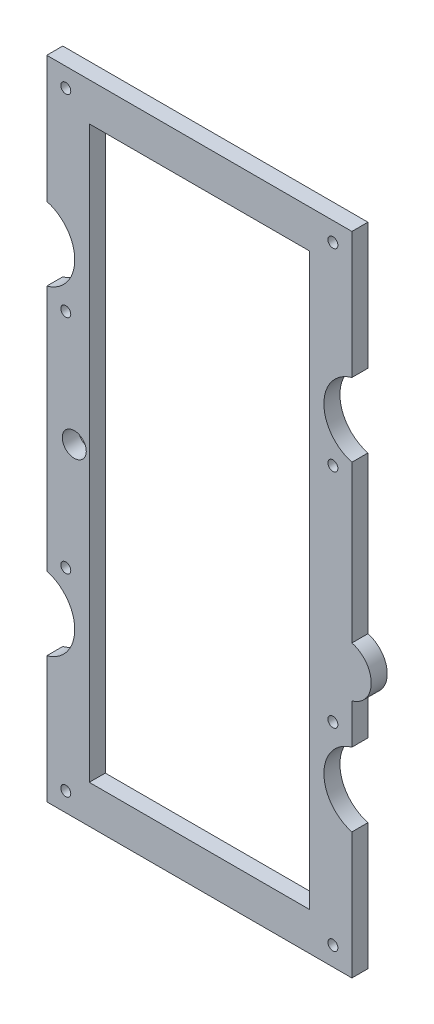
ISO-10303-21;
HEADER;
FILE_DESCRIPTION(('STEP AP214'),'2;1');
FILE_NAME('part.step','',(''),(''),'','','');
FILE_SCHEMA(('AUTOMOTIVE_DESIGN { 1 0 10303 214 1 1 1 1 }'));
ENDSEC;
DATA;
#1=APPLICATION_CONTEXT('core data for automotive mechanical design processes');
#2=APPLICATION_PROTOCOL_DEFINITION('international standard','automotive_design',2000,#1);
#3=PRODUCT_CONTEXT('',#1,'mechanical');
#4=PRODUCT('Part','Part','',(#3));
#5=PRODUCT_RELATED_PRODUCT_CATEGORY('part','',(#4));
#6=PRODUCT_DEFINITION_FORMATION('','',#4);
#7=PRODUCT_DEFINITION_CONTEXT('part definition',#1,'design');
#8=PRODUCT_DEFINITION('design','',#6,#7);
#9=PRODUCT_DEFINITION_SHAPE('','',#8);
#10=(LENGTH_UNIT() NAMED_UNIT(*) SI_UNIT(.MILLI.,.METRE.));
#11=(NAMED_UNIT(*) PLANE_ANGLE_UNIT() SI_UNIT($,.RADIAN.));
#12=(NAMED_UNIT(*) SI_UNIT($,.STERADIAN.) SOLID_ANGLE_UNIT());
#13=UNCERTAINTY_MEASURE_WITH_UNIT(LENGTH_MEASURE(1.E-05),#10,'distance_accuracy_value','');
#14=(GEOMETRIC_REPRESENTATION_CONTEXT(3) GLOBAL_UNCERTAINTY_ASSIGNED_CONTEXT((#13)) GLOBAL_UNIT_ASSIGNED_CONTEXT((#10,
#11,#12)) REPRESENTATION_CONTEXT('',''));
#15=CARTESIAN_POINT('',(0.,0.,0.));
#16=DIRECTION('',(0.,0.,1.));
#17=DIRECTION('',(1.,0.,0.));
#18=AXIS2_PLACEMENT_3D('',#15,#16,#17);
#19=CARTESIAN_POINT('',(-66.080112923463,-920.000000000007,8.));
#20=DIRECTION('',(0.,0.,1.));
#21=DIRECTION('',(1.,0.,0.));
#22=AXIS2_PLACEMENT_3D('',#19,#20,#21);
#23=PLANE('',#22);
#24=CARTESIAN_POINT('',(-47.330112923463,-1000.00000000001,8.));
#25=DIRECTION('',(0.,0.,1.));
#26=DIRECTION('',(1.,0.,0.));
#27=AXIS2_PLACEMENT_3D('',#24,#25,#26);
#28=CIRCLE('',#27,6.);
#29=CARTESIAN_POINT('',(-41.330112923463,-1000.00000000001,8.));
#30=VERTEX_POINT('',#29);
#31=EDGE_CURVE('E191',#30,#30,#28,.T.);
#32=ORIENTED_EDGE('',*,*,#31,.F.);
#33=EDGE_LOOP('',(#32));
#34=FACE_BOUND('',#33,.T.);
#35=DIRECTION('',(0.,-1.,0.));
#36=VECTOR('',#35,1.);
#37=CARTESIAN_POINT('',(70.1698870765371,-857.500000000008,8.));
#38=LINE('',#37,#36);
#39=CARTESIAN_POINT('',(70.1698870765371,-857.500000000008,8.));
#40=VERTEX_POINT('',#39);
#41=CARTESIAN_POINT('',(70.169887076537,-1142.50000000001,8.));
#42=VERTEX_POINT('',#41);
#43=EDGE_CURVE('E170',#40,#42,#38,.T.);
#44=ORIENTED_EDGE('',*,*,#43,.T.);
#45=DIRECTION('',(-1.,0.,0.));
#46=VECTOR('',#45,1.);
#47=CARTESIAN_POINT('',(70.169887076537,-1142.50000000001,8.));
#48=LINE('',#47,#46);
#49=CARTESIAN_POINT('',(-39.830112923463,-1142.50000000001,8.));
#50=VERTEX_POINT('',#49);
#51=EDGE_CURVE('E179',#42,#50,#48,.T.);
#52=ORIENTED_EDGE('',*,*,#51,.T.);
#53=DIRECTION('',(0.,1.,0.));
#54=VECTOR('',#53,1.);
#55=CARTESIAN_POINT('',(-39.8301129234629,-857.500000000008,8.));
#56=LINE('',#55,#54);
#57=CARTESIAN_POINT('',(-39.8301129234629,-857.500000000008,8.));
#58=VERTEX_POINT('',#57);
#59=EDGE_CURVE('E58',#50,#58,#56,.T.);
#60=ORIENTED_EDGE('',*,*,#59,.T.);
#61=DIRECTION('',(1.,0.,0.));
#62=VECTOR('',#61,1.);
#63=CARTESIAN_POINT('',(70.1698870765371,-857.500000000008,8.));
#64=LINE('',#63,#62);
#65=EDGE_CURVE('E176',#58,#40,#64,.T.);
#66=ORIENTED_EDGE('',*,*,#65,.T.);
#67=EDGE_LOOP('',(#44,#52,#60,#66));
#68=FACE_BOUND('',#67,.T.);
#69=CARTESIAN_POINT('',(-51.580112923463,-1152.06262000001,8.));
#70=DIRECTION('',(0.,0.,1.));
#71=DIRECTION('',(1.,0.,0.));
#72=AXIS2_PLACEMENT_3D('',#69,#70,#71);
#73=CIRCLE('',#72,2.50000000000014);
#74=CARTESIAN_POINT('',(-49.0801129234629,-1152.06262000001,8.));
#75=VERTEX_POINT('',#74);
#76=EDGE_CURVE('E214',#75,#75,#73,.T.);
#77=ORIENTED_EDGE('',*,*,#76,.F.);
#78=EDGE_LOOP('',(#77));
#79=FACE_BOUND('',#78,.T.);
#80=CARTESIAN_POINT('',(81.9198870765371,-1055.46431170724,8.));
#81=DIRECTION('',(0.,0.,1.));
#82=DIRECTION('',(1.,0.,0.));
#83=AXIS2_PLACEMENT_3D('',#80,#81,#82);
#84=CIRCLE('',#83,2.49999999999987);
#85=CARTESIAN_POINT('',(84.4198870765369,-1055.46431170724,8.));
#86=VERTEX_POINT('',#85);
#87=EDGE_CURVE('E226',#86,#86,#84,.T.);
#88=ORIENTED_EDGE('',*,*,#87,.F.);
#89=EDGE_LOOP('',(#88));
#90=FACE_BOUND('',#89,.T.);
#91=CARTESIAN_POINT('',(81.9198870765371,-847.937380000007,8.));
#92=DIRECTION('',(0.,0.,1.));
#93=DIRECTION('',(1.,0.,0.));
#94=AXIS2_PLACEMENT_3D('',#91,#92,#93);
#95=CIRCLE('',#94,2.5);
#96=CARTESIAN_POINT('',(84.4198870765371,-847.937380000007,8.));
#97=VERTEX_POINT('',#96);
#98=EDGE_CURVE('E238',#97,#97,#95,.T.);
#99=ORIENTED_EDGE('',*,*,#98,.F.);
#100=EDGE_LOOP('',(#99));
#101=FACE_BOUND('',#100,.T.);
#102=CARTESIAN_POINT('',(81.9198870765371,-944.535688292778,8.));
#103=DIRECTION('',(0.,0.,1.));
#104=DIRECTION('',(1.,0.,0.));
#105=AXIS2_PLACEMENT_3D('',#102,#103,#104);
#106=CIRCLE('',#105,2.5);
#107=CARTESIAN_POINT('',(84.4198870765371,-944.535688292778,8.));
#108=VERTEX_POINT('',#107);
#109=EDGE_CURVE('E250',#108,#108,#106,.T.);
#110=ORIENTED_EDGE('',*,*,#109,.F.);
#111=EDGE_LOOP('',(#110));
#112=FACE_BOUND('',#111,.T.);
#113=CARTESIAN_POINT('',(-66.080112923463,-920.000000000007,8.));
#114=DIRECTION('',(0.,0.,-1.));
#115=DIRECTION('',(1.,0.,0.));
#116=AXIS2_PLACEMENT_3D('',#113,#114,#115);
#117=CIRCLE('',#116,18.9999999999999);
#118=CARTESIAN_POINT('',(-61.0801129234629,-901.669697220184,8.));
#119=VERTEX_POINT('',#118);
#120=CARTESIAN_POINT('',(-61.080112923463,-938.33030277983,8.));
#121=VERTEX_POINT('',#120);
#122=EDGE_CURVE('E256',#119,#121,#117,.T.);
#123=ORIENTED_EDGE('',*,*,#122,.T.);
#124=DIRECTION('',(0.,-1.,0.));
#125=VECTOR('',#124,1.);
#126=CARTESIAN_POINT('',(-61.080112923463,-938.33030277983,8.));
#127=LINE('',#126,#125);
#128=CARTESIAN_POINT('',(-61.080112923463,-1061.66969722018,8.));
#129=VERTEX_POINT('',#128);
#130=EDGE_CURVE('E259',#121,#129,#127,.T.);
#131=ORIENTED_EDGE('',*,*,#130,.T.);
#132=CARTESIAN_POINT('',(-66.080112923463,-1080.00000000001,8.));
#133=DIRECTION('',(0.,0.,-1.));
#134=DIRECTION('',(1.,0.,0.));
#135=AXIS2_PLACEMENT_3D('',#132,#133,#134);
#136=CIRCLE('',#135,19.);
#137=CARTESIAN_POINT('',(-61.080112923463,-1098.33030277983,8.));
#138=VERTEX_POINT('',#137);
#139=EDGE_CURVE('E262',#129,#138,#136,.T.);
#140=ORIENTED_EDGE('',*,*,#139,.T.);
#141=DIRECTION('',(0.,-1.,0.));
#142=VECTOR('',#141,1.);
#143=CARTESIAN_POINT('',(-61.080112923463,-1098.33030277983,8.));
#144=LINE('',#143,#142);
#145=CARTESIAN_POINT('',(-61.080112923463,-1161.56262000001,8.));
#146=VERTEX_POINT('',#145);
#147=EDGE_CURVE('E264',#138,#146,#144,.T.);
#148=ORIENTED_EDGE('',*,*,#147,.T.);
#149=DIRECTION('',(1.,0.,0.));
#150=VECTOR('',#149,1.);
#151=CARTESIAN_POINT('',(-61.080112923463,-1161.56262000001,8.));
#152=LINE('',#151,#150);
#153=CARTESIAN_POINT('',(91.4198870765371,-1161.56262000001,8.));
#154=VERTEX_POINT('',#153);
#155=EDGE_CURVE('E266',#146,#154,#152,.T.);
#156=ORIENTED_EDGE('',*,*,#155,.T.);
#157=DIRECTION('',(0.,1.,0.));
#158=VECTOR('',#157,1.);
#159=CARTESIAN_POINT('',(91.4198870765371,-1161.56262000001,8.));
#160=LINE('',#159,#158);
#161=CARTESIAN_POINT('',(91.4198870765371,-1098.33030277983,8.));
#162=VERTEX_POINT('',#161);
#163=EDGE_CURVE('E268',#154,#162,#160,.T.);
#164=ORIENTED_EDGE('',*,*,#163,.T.);
#165=CARTESIAN_POINT('',(96.4198870765371,-1080.00000000001,8.));
#166=DIRECTION('',(0.,0.,-1.));
#167=DIRECTION('',(1.,0.,0.));
#168=AXIS2_PLACEMENT_3D('',#165,#166,#167);
#169=CIRCLE('',#168,19.);
#170=CARTESIAN_POINT('',(91.4198870765371,-1061.66969722018,8.));
#171=VERTEX_POINT('',#170);
#172=EDGE_CURVE('E270',#162,#171,#169,.T.);
#173=ORIENTED_EDGE('',*,*,#172,.T.);
#174=DIRECTION('',(0.,1.,0.));
#175=VECTOR('',#174,1.);
#176=CARTESIAN_POINT('',(91.4198870765371,-1061.66969722018,8.));
#177=LINE('',#176,#175);
#178=CARTESIAN_POINT('',(91.4198870765371,-1041.59686833573,8.));
#179=VERTEX_POINT('',#178);
#180=EDGE_CURVE('E272',#171,#179,#177,.T.);
#181=ORIENTED_EDGE('',*,*,#180,.T.);
#182=CARTESIAN_POINT('',(88.1478081868197,-1029.07998350006,8.));
#183=DIRECTION('',(0.,0.,1.));
#184=DIRECTION('',(1.,0.,0.));
#185=AXIS2_PLACEMENT_3D('',#182,#183,#184);
#186=CIRCLE('',#185,12.9375);
#187=CARTESIAN_POINT('',(91.4198870765371,-1016.56309866439,8.));
#188=VERTEX_POINT('',#187);
#189=EDGE_CURVE('E274',#179,#188,#186,.T.);
#190=ORIENTED_EDGE('',*,*,#189,.T.);
#191=DIRECTION('',(0.,1.,0.));
#192=VECTOR('',#191,1.);
#193=CARTESIAN_POINT('',(91.4198870765371,-1016.56309866439,8.));
#194=LINE('',#193,#192);
#195=CARTESIAN_POINT('',(91.4198870765371,-938.33030277983,8.));
#196=VERTEX_POINT('',#195);
#197=EDGE_CURVE('E276',#188,#196,#194,.T.);
#198=ORIENTED_EDGE('',*,*,#197,.T.);
#199=CARTESIAN_POINT('',(96.4198870765371,-920.000000000007,8.));
#200=DIRECTION('',(0.,0.,-1.));
#201=DIRECTION('',(1.,0.,0.));
#202=AXIS2_PLACEMENT_3D('',#199,#200,#201);
#203=CIRCLE('',#202,18.9999999999999);
#204=CARTESIAN_POINT('',(91.4198870765371,-901.669697220184,8.));
#205=VERTEX_POINT('',#204);
#206=EDGE_CURVE('E278',#196,#205,#203,.T.);
#207=ORIENTED_EDGE('',*,*,#206,.T.);
#208=DIRECTION('',(0.,1.,0.));
#209=VECTOR('',#208,1.);
#210=CARTESIAN_POINT('',(91.4198870765371,-901.669697220184,8.));
#211=LINE('',#210,#209);
#212=CARTESIAN_POINT('',(91.4198870765371,-838.437380000007,8.));
#213=VERTEX_POINT('',#212);
#214=EDGE_CURVE('E280',#205,#213,#211,.T.);
#215=ORIENTED_EDGE('',*,*,#214,.T.);
#216=DIRECTION('',(-1.,0.,0.));
#217=VECTOR('',#216,1.);
#218=CARTESIAN_POINT('',(91.4198870765371,-838.437380000007,8.));
#219=LINE('',#218,#217);
#220=CARTESIAN_POINT('',(-61.080112923463,-838.437380000007,8.));
#221=VERTEX_POINT('',#220);
#222=EDGE_CURVE('E282',#213,#221,#219,.T.);
#223=ORIENTED_EDGE('',*,*,#222,.T.);
#224=DIRECTION('',(0.,-1.,0.));
#225=VECTOR('',#224,1.);
#226=CARTESIAN_POINT('',(-61.080112923463,-838.437380000007,8.));
#227=LINE('',#226,#225);
#228=EDGE_CURVE('E284',#221,#119,#227,.T.);
#229=ORIENTED_EDGE('',*,*,#228,.T.);
#230=EDGE_LOOP('',(#123,#131,#140,#148,#156,#164,#173,#181,#190,#198,#207,#215,#223,#229));
#231=FACE_BOUND('',#230,.T.);
#232=CARTESIAN_POINT('',(-51.580112923463,-944.535688292778,8.));
#233=DIRECTION('',(0.,0.,1.));
#234=DIRECTION('',(1.,0.,0.));
#235=AXIS2_PLACEMENT_3D('',#232,#233,#234);
#236=CIRCLE('',#235,2.50000000000001);
#237=CARTESIAN_POINT('',(-49.080112923463,-944.535688292778,8.));
#238=VERTEX_POINT('',#237);
#239=EDGE_CURVE('E244',#238,#238,#236,.T.);
#240=ORIENTED_EDGE('',*,*,#239,.F.);
#241=EDGE_LOOP('',(#240));
#242=FACE_BOUND('',#241,.T.);
#243=CARTESIAN_POINT('',(-51.580112923463,-1055.46431170724,8.));
#244=DIRECTION('',(0.,0.,1.));
#245=DIRECTION('',(1.,0.,0.));
#246=AXIS2_PLACEMENT_3D('',#243,#244,#245);
#247=CIRCLE('',#246,2.49999999999988);
#248=CARTESIAN_POINT('',(-49.0801129234631,-1055.46431170724,8.));
#249=VERTEX_POINT('',#248);
#250=EDGE_CURVE('E232',#249,#249,#247,.T.);
#251=ORIENTED_EDGE('',*,*,#250,.F.);
#252=EDGE_LOOP('',(#251));
#253=FACE_BOUND('',#252,.T.);
#254=CARTESIAN_POINT('',(81.9198870765371,-1152.06262000001,8.));
#255=DIRECTION('',(0.,0.,1.));
#256=DIRECTION('',(1.,0.,0.));
#257=AXIS2_PLACEMENT_3D('',#254,#255,#256);
#258=CIRCLE('',#257,2.49999999999987);
#259=CARTESIAN_POINT('',(84.4198870765369,-1152.06262000001,8.));
#260=VERTEX_POINT('',#259);
#261=EDGE_CURVE('E220',#260,#260,#258,.T.);
#262=ORIENTED_EDGE('',*,*,#261,.F.);
#263=EDGE_LOOP('',(#262));
#264=FACE_BOUND('',#263,.T.);
#265=CARTESIAN_POINT('',(-51.580112923463,-847.937380000007,8.));
#266=DIRECTION('',(0.,0.,1.));
#267=DIRECTION('',(1.,0.,0.));
#268=AXIS2_PLACEMENT_3D('',#265,#266,#267);
#269=CIRCLE('',#268,2.50000000000001);
#270=CARTESIAN_POINT('',(-49.080112923463,-847.937380000007,8.));
#271=VERTEX_POINT('',#270);
#272=EDGE_CURVE('E208',#271,#271,#269,.T.);
#273=ORIENTED_EDGE('',*,*,#272,.F.);
#274=EDGE_LOOP('',(#273));
#275=FACE_BOUND('',#274,.T.);
#276=ADVANCED_FACE('F43',(#34,#68,#79,#90,#101,#112,#231,#242,#253,#264,#275),#23,.T.);
#277=CARTESIAN_POINT('',(-66.080112923463,-920.000000000007,0.));
#278=DIRECTION('',(0.,0.,1.));
#279=DIRECTION('',(1.,0.,0.));
#280=AXIS2_PLACEMENT_3D('',#277,#278,#279);
#281=PLANE('',#280);
#282=CARTESIAN_POINT('',(-47.330112923463,-1000.00000000001,0.));
#283=DIRECTION('',(0.,0.,1.));
#284=DIRECTION('',(1.,0.,0.));
#285=AXIS2_PLACEMENT_3D('',#282,#283,#284);
#286=CIRCLE('',#285,6.);
#287=CARTESIAN_POINT('',(-41.330112923463,-1000.00000000001,0.));
#288=VERTEX_POINT('',#287);
#289=EDGE_CURVE('E198',#288,#288,#286,.T.);
#290=ORIENTED_EDGE('',*,*,#289,.T.);
#291=EDGE_LOOP('',(#290));
#292=FACE_BOUND('',#291,.T.);
#293=DIRECTION('',(-1.,0.,0.));
#294=VECTOR('',#293,1.);
#295=CARTESIAN_POINT('',(70.169887076537,-1142.50000000001,0.));
#296=LINE('',#295,#294);
#297=CARTESIAN_POINT('',(70.169887076537,-1142.50000000001,0.));
#298=VERTEX_POINT('',#297);
#299=CARTESIAN_POINT('',(-39.830112923463,-1142.50000000001,0.));
#300=VERTEX_POINT('',#299);
#301=EDGE_CURVE('E197',#298,#300,#296,.T.);
#302=ORIENTED_EDGE('',*,*,#301,.F.);
#303=DIRECTION('',(0.,-1.,0.));
#304=VECTOR('',#303,1.);
#305=CARTESIAN_POINT('',(70.1698870765371,-857.500000000008,0.));
#306=LINE('',#305,#304);
#307=CARTESIAN_POINT('',(70.1698870765371,-857.500000000008,0.));
#308=VERTEX_POINT('',#307);
#309=EDGE_CURVE('E66',#308,#298,#306,.T.);
#310=ORIENTED_EDGE('',*,*,#309,.F.);
#311=DIRECTION('',(1.,0.,0.));
#312=VECTOR('',#311,1.);
#313=CARTESIAN_POINT('',(70.1698870765371,-857.500000000008,0.));
#314=LINE('',#313,#312);
#315=CARTESIAN_POINT('',(-39.8301129234629,-857.500000000008,0.));
#316=VERTEX_POINT('',#315);
#317=EDGE_CURVE('E185',#316,#308,#314,.T.);
#318=ORIENTED_EDGE('',*,*,#317,.F.);
#319=DIRECTION('',(0.,1.,0.));
#320=VECTOR('',#319,1.);
#321=CARTESIAN_POINT('',(-39.8301129234629,-857.500000000008,0.));
#322=LINE('',#321,#320);
#323=EDGE_CURVE('E188',#300,#316,#322,.T.);
#324=ORIENTED_EDGE('',*,*,#323,.F.);
#325=EDGE_LOOP('',(#302,#310,#318,#324));
#326=FACE_BOUND('',#325,.T.);
#327=CARTESIAN_POINT('',(-66.080112923463,-920.000000000007,0.));
#328=DIRECTION('',(0.,0.,-1.));
#329=DIRECTION('',(1.,0.,0.));
#330=AXIS2_PLACEMENT_3D('',#327,#328,#329);
#331=CIRCLE('',#330,18.9999999999999);
#332=CARTESIAN_POINT('',(-61.0801129234629,-901.669697220184,0.));
#333=VERTEX_POINT('',#332);
#334=CARTESIAN_POINT('',(-61.080112923463,-938.33030277983,0.));
#335=VERTEX_POINT('',#334);
#336=EDGE_CURVE('E253',#333,#335,#331,.T.);
#337=ORIENTED_EDGE('',*,*,#336,.F.);
#338=DIRECTION('',(0.,-1.,0.));
#339=VECTOR('',#338,1.);
#340=CARTESIAN_POINT('',(-61.080112923463,-838.437380000007,0.));
#341=LINE('',#340,#339);
#342=CARTESIAN_POINT('',(-61.080112923463,-838.437380000007,0.));
#343=VERTEX_POINT('',#342);
#344=EDGE_CURVE('E260',#343,#333,#341,.T.);
#345=ORIENTED_EDGE('',*,*,#344,.F.);
#346=DIRECTION('',(-1.,0.,0.));
#347=VECTOR('',#346,1.);
#348=CARTESIAN_POINT('',(91.4198870765371,-838.437380000007,0.));
#349=LINE('',#348,#347);
#350=CARTESIAN_POINT('',(91.4198870765371,-838.437380000007,0.));
#351=VERTEX_POINT('',#350);
#352=EDGE_CURVE('E311',#351,#343,#349,.T.);
#353=ORIENTED_EDGE('',*,*,#352,.F.);
#354=DIRECTION('',(0.,1.,0.));
#355=VECTOR('',#354,1.);
#356=CARTESIAN_POINT('',(91.4198870765371,-901.669697220184,0.));
#357=LINE('',#356,#355);
#358=CARTESIAN_POINT('',(91.4198870765371,-901.669697220184,0.));
#359=VERTEX_POINT('',#358);
#360=EDGE_CURVE('E309',#359,#351,#357,.T.);
#361=ORIENTED_EDGE('',*,*,#360,.F.);
#362=CARTESIAN_POINT('',(96.4198870765371,-920.000000000007,0.));
#363=DIRECTION('',(0.,0.,-1.));
#364=DIRECTION('',(1.,0.,0.));
#365=AXIS2_PLACEMENT_3D('',#362,#363,#364);
#366=CIRCLE('',#365,18.9999999999999);
#367=CARTESIAN_POINT('',(91.4198870765371,-938.33030277983,0.));
#368=VERTEX_POINT('',#367);
#369=EDGE_CURVE('E307',#368,#359,#366,.T.);
#370=ORIENTED_EDGE('',*,*,#369,.F.);
#371=DIRECTION('',(0.,1.,0.));
#372=VECTOR('',#371,1.);
#373=CARTESIAN_POINT('',(91.4198870765371,-1016.56309866439,0.));
#374=LINE('',#373,#372);
#375=CARTESIAN_POINT('',(91.4198870765371,-1016.56309866439,0.));
#376=VERTEX_POINT('',#375);
#377=EDGE_CURVE('E305',#376,#368,#374,.T.);
#378=ORIENTED_EDGE('',*,*,#377,.F.);
#379=CARTESIAN_POINT('',(88.1478081868197,-1029.07998350006,0.));
#380=DIRECTION('',(0.,0.,1.));
#381=DIRECTION('',(1.,0.,0.));
#382=AXIS2_PLACEMENT_3D('',#379,#380,#381);
#383=CIRCLE('',#382,12.9375);
#384=CARTESIAN_POINT('',(91.4198870765371,-1041.59686833573,0.));
#385=VERTEX_POINT('',#384);
#386=EDGE_CURVE('E303',#385,#376,#383,.T.);
#387=ORIENTED_EDGE('',*,*,#386,.F.);
#388=DIRECTION('',(0.,1.,0.));
#389=VECTOR('',#388,1.);
#390=CARTESIAN_POINT('',(91.4198870765371,-1061.66969722018,0.));
#391=LINE('',#390,#389);
#392=CARTESIAN_POINT('',(91.4198870765371,-1061.66969722018,0.));
#393=VERTEX_POINT('',#392);
#394=EDGE_CURVE('E301',#393,#385,#391,.T.);
#395=ORIENTED_EDGE('',*,*,#394,.F.);
#396=CARTESIAN_POINT('',(96.4198870765371,-1080.00000000001,0.));
#397=DIRECTION('',(0.,0.,-1.));
#398=DIRECTION('',(1.,0.,0.));
#399=AXIS2_PLACEMENT_3D('',#396,#397,#398);
#400=CIRCLE('',#399,19.);
#401=CARTESIAN_POINT('',(91.4198870765371,-1098.33030277983,0.));
#402=VERTEX_POINT('',#401);
#403=EDGE_CURVE('E299',#402,#393,#400,.T.);
#404=ORIENTED_EDGE('',*,*,#403,.F.);
#405=DIRECTION('',(0.,1.,0.));
#406=VECTOR('',#405,1.);
#407=CARTESIAN_POINT('',(91.4198870765371,-1161.56262000001,0.));
#408=LINE('',#407,#406);
#409=CARTESIAN_POINT('',(91.4198870765371,-1161.56262000001,0.));
#410=VERTEX_POINT('',#409);
#411=EDGE_CURVE('E297',#410,#402,#408,.T.);
#412=ORIENTED_EDGE('',*,*,#411,.F.);
#413=DIRECTION('',(1.,0.,0.));
#414=VECTOR('',#413,1.);
#415=CARTESIAN_POINT('',(-61.080112923463,-1161.56262000001,0.));
#416=LINE('',#415,#414);
#417=CARTESIAN_POINT('',(-61.080112923463,-1161.56262000001,0.));
#418=VERTEX_POINT('',#417);
#419=EDGE_CURVE('E295',#418,#410,#416,.T.);
#420=ORIENTED_EDGE('',*,*,#419,.F.);
#421=DIRECTION('',(0.,-1.,0.));
#422=VECTOR('',#421,1.);
#423=CARTESIAN_POINT('',(-61.080112923463,-1098.33030277983,0.));
#424=LINE('',#423,#422);
#425=CARTESIAN_POINT('',(-61.080112923463,-1098.33030277983,0.));
#426=VERTEX_POINT('',#425);
#427=EDGE_CURVE('E293',#426,#418,#424,.T.);
#428=ORIENTED_EDGE('',*,*,#427,.F.);
#429=CARTESIAN_POINT('',(-66.080112923463,-1080.00000000001,0.));
#430=DIRECTION('',(0.,0.,-1.));
#431=DIRECTION('',(1.,0.,0.));
#432=AXIS2_PLACEMENT_3D('',#429,#430,#431);
#433=CIRCLE('',#432,19.);
#434=CARTESIAN_POINT('',(-61.080112923463,-1061.66969722018,0.));
#435=VERTEX_POINT('',#434);
#436=EDGE_CURVE('E291',#435,#426,#433,.T.);
#437=ORIENTED_EDGE('',*,*,#436,.F.);
#438=DIRECTION('',(0.,-1.,0.));
#439=VECTOR('',#438,1.);
#440=CARTESIAN_POINT('',(-61.080112923463,-938.33030277983,0.));
#441=LINE('',#440,#439);
#442=EDGE_CURVE('E289',#335,#435,#441,.T.);
#443=ORIENTED_EDGE('',*,*,#442,.F.);
#444=EDGE_LOOP('',(#337,#345,#353,#361,#370,#378,#387,#395,#404,#412,#420,#428,#437,#443));
#445=FACE_BOUND('',#444,.T.);
#446=CARTESIAN_POINT('',(81.9198870765371,-944.535688292778,0.));
#447=DIRECTION('',(0.,0.,1.));
#448=DIRECTION('',(1.,0.,0.));
#449=AXIS2_PLACEMENT_3D('',#446,#447,#448);
#450=CIRCLE('',#449,2.5);
#451=CARTESIAN_POINT('',(84.4198870765371,-944.535688292778,0.));
#452=VERTEX_POINT('',#451);
#453=EDGE_CURVE('E247',#452,#452,#450,.T.);
#454=ORIENTED_EDGE('',*,*,#453,.T.);
#455=EDGE_LOOP('',(#454));
#456=FACE_BOUND('',#455,.T.);
#457=CARTESIAN_POINT('',(-51.580112923463,-944.535688292778,0.));
#458=DIRECTION('',(0.,0.,1.));
#459=DIRECTION('',(1.,0.,0.));
#460=AXIS2_PLACEMENT_3D('',#457,#458,#459);
#461=CIRCLE('',#460,2.50000000000001);
#462=CARTESIAN_POINT('',(-49.080112923463,-944.535688292778,0.));
#463=VERTEX_POINT('',#462);
#464=EDGE_CURVE('E241',#463,#463,#461,.T.);
#465=ORIENTED_EDGE('',*,*,#464,.T.);
#466=EDGE_LOOP('',(#465));
#467=FACE_BOUND('',#466,.T.);
#468=CARTESIAN_POINT('',(81.9198870765371,-847.937380000007,0.));
#469=DIRECTION('',(0.,0.,1.));
#470=DIRECTION('',(1.,0.,0.));
#471=AXIS2_PLACEMENT_3D('',#468,#469,#470);
#472=CIRCLE('',#471,2.5);
#473=CARTESIAN_POINT('',(84.4198870765371,-847.937380000007,0.));
#474=VERTEX_POINT('',#473);
#475=EDGE_CURVE('E235',#474,#474,#472,.T.);
#476=ORIENTED_EDGE('',*,*,#475,.T.);
#477=EDGE_LOOP('',(#476));
#478=FACE_BOUND('',#477,.T.);
#479=CARTESIAN_POINT('',(-51.580112923463,-1055.46431170724,0.));
#480=DIRECTION('',(0.,0.,1.));
#481=DIRECTION('',(1.,0.,0.));
#482=AXIS2_PLACEMENT_3D('',#479,#480,#481);
#483=CIRCLE('',#482,2.49999999999988);
#484=CARTESIAN_POINT('',(-49.0801129234631,-1055.46431170724,0.));
#485=VERTEX_POINT('',#484);
#486=EDGE_CURVE('E229',#485,#485,#483,.T.);
#487=ORIENTED_EDGE('',*,*,#486,.T.);
#488=EDGE_LOOP('',(#487));
#489=FACE_BOUND('',#488,.T.);
#490=CARTESIAN_POINT('',(81.9198870765371,-1055.46431170724,0.));
#491=DIRECTION('',(0.,0.,1.));
#492=DIRECTION('',(1.,0.,0.));
#493=AXIS2_PLACEMENT_3D('',#490,#491,#492);
#494=CIRCLE('',#493,2.49999999999987);
#495=CARTESIAN_POINT('',(84.4198870765369,-1055.46431170724,0.));
#496=VERTEX_POINT('',#495);
#497=EDGE_CURVE('E223',#496,#496,#494,.T.);
#498=ORIENTED_EDGE('',*,*,#497,.T.);
#499=EDGE_LOOP('',(#498));
#500=FACE_BOUND('',#499,.T.);
#501=CARTESIAN_POINT('',(81.9198870765371,-1152.06262000001,0.));
#502=DIRECTION('',(0.,0.,1.));
#503=DIRECTION('',(1.,0.,0.));
#504=AXIS2_PLACEMENT_3D('',#501,#502,#503);
#505=CIRCLE('',#504,2.49999999999987);
#506=CARTESIAN_POINT('',(84.4198870765369,-1152.06262000001,0.));
#507=VERTEX_POINT('',#506);
#508=EDGE_CURVE('E217',#507,#507,#505,.T.);
#509=ORIENTED_EDGE('',*,*,#508,.T.);
#510=EDGE_LOOP('',(#509));
#511=FACE_BOUND('',#510,.T.);
#512=CARTESIAN_POINT('',(-51.580112923463,-1152.06262000001,0.));
#513=DIRECTION('',(0.,0.,1.));
#514=DIRECTION('',(1.,0.,0.));
#515=AXIS2_PLACEMENT_3D('',#512,#513,#514);
#516=CIRCLE('',#515,2.50000000000014);
#517=CARTESIAN_POINT('',(-49.0801129234629,-1152.06262000001,0.));
#518=VERTEX_POINT('',#517);
#519=EDGE_CURVE('E211',#518,#518,#516,.T.);
#520=ORIENTED_EDGE('',*,*,#519,.T.);
#521=EDGE_LOOP('',(#520));
#522=FACE_BOUND('',#521,.T.);
#523=CARTESIAN_POINT('',(-51.580112923463,-847.937380000007,0.));
#524=DIRECTION('',(0.,0.,1.));
#525=DIRECTION('',(1.,0.,0.));
#526=AXIS2_PLACEMENT_3D('',#523,#524,#525);
#527=CIRCLE('',#526,2.50000000000001);
#528=CARTESIAN_POINT('',(-49.080112923463,-847.937380000007,0.));
#529=VERTEX_POINT('',#528);
#530=EDGE_CURVE('E204',#529,#529,#527,.T.);
#531=ORIENTED_EDGE('',*,*,#530,.T.);
#532=EDGE_LOOP('',(#531));
#533=FACE_BOUND('',#532,.T.);
#534=ADVANCED_FACE('F359',(#292,#326,#445,#456,#467,#478,#489,#500,#511,#522,#533),#281,.F.);
#535=CARTESIAN_POINT('',(-66.080112923463,-920.000000000007,8.));
#536=DIRECTION('',(0.,0.,-1.));
#537=DIRECTION('',(-1.,0.,0.));
#538=AXIS2_PLACEMENT_3D('',#535,#536,#537);
#539=CYLINDRICAL_SURFACE('',#538,18.9999999999999);
#540=ORIENTED_EDGE('',*,*,#336,.T.);
#541=DIRECTION('',(0.,0.,-1.));
#542=VECTOR('',#541,1.);
#543=CARTESIAN_POINT('',(-61.080112923463,-938.33030277983,8.));
#544=LINE('',#543,#542);
#545=EDGE_CURVE('E11',#121,#335,#544,.T.);
#546=ORIENTED_EDGE('',*,*,#545,.F.);
#547=ORIENTED_EDGE('',*,*,#122,.F.);
#548=DIRECTION('',(0.,0.,-1.));
#549=VECTOR('',#548,1.);
#550=CARTESIAN_POINT('',(-61.0801129234629,-901.669697220184,8.));
#551=LINE('',#550,#549);
#552=EDGE_CURVE('E286',#119,#333,#551,.T.);
#553=ORIENTED_EDGE('',*,*,#552,.T.);
#554=EDGE_LOOP('',(#540,#546,#547,#553));
#555=FACE_BOUND('',#554,.T.);
#556=ADVANCED_FACE('F45',(#555),#539,.F.);
#557=CARTESIAN_POINT('',(-61.080112923463,-938.33030277983,8.));
#558=DIRECTION('',(1.,0.,0.));
#559=DIRECTION('',(0.,1.,0.));
#560=AXIS2_PLACEMENT_3D('',#557,#558,#559);
#561=PLANE('',#560);
#562=ORIENTED_EDGE('',*,*,#442,.T.);
#563=DIRECTION('',(0.,0.,-1.));
#564=VECTOR('',#563,1.);
#565=CARTESIAN_POINT('',(-61.080112923463,-1061.66969722018,8.));
#566=LINE('',#565,#564);
#567=EDGE_CURVE('E51',#129,#435,#566,.T.);
#568=ORIENTED_EDGE('',*,*,#567,.F.);
#569=ORIENTED_EDGE('',*,*,#130,.F.);
#570=ORIENTED_EDGE('',*,*,#545,.T.);
#571=EDGE_LOOP('',(#562,#568,#569,#570));
#572=FACE_BOUND('',#571,.T.);
#573=ADVANCED_FACE('F377',(#572),#561,.F.);
#574=CARTESIAN_POINT('',(-66.080112923463,-1080.00000000001,8.));
#575=DIRECTION('',(0.,0.,-1.));
#576=DIRECTION('',(-1.,0.,0.));
#577=AXIS2_PLACEMENT_3D('',#574,#575,#576);
#578=CYLINDRICAL_SURFACE('',#577,19.);
#579=ORIENTED_EDGE('',*,*,#436,.T.);
#580=DIRECTION('',(0.,0.,-1.));
#581=VECTOR('',#580,1.);
#582=CARTESIAN_POINT('',(-61.080112923463,-1098.33030277983,8.));
#583=LINE('',#582,#581);
#584=EDGE_CURVE('E346',#138,#426,#583,.T.);
#585=ORIENTED_EDGE('',*,*,#584,.F.);
#586=ORIENTED_EDGE('',*,*,#139,.F.);
#587=ORIENTED_EDGE('',*,*,#567,.T.);
#588=EDGE_LOOP('',(#579,#585,#586,#587));
#589=FACE_BOUND('',#588,.T.);
#590=ADVANCED_FACE('F353',(#589),#578,.F.);
#591=CARTESIAN_POINT('',(-61.080112923463,-1098.33030277983,8.));
#592=DIRECTION('',(1.,0.,0.));
#593=DIRECTION('',(0.,1.,0.));
#594=AXIS2_PLACEMENT_3D('',#591,#592,#593);
#595=PLANE('',#594);
#596=ORIENTED_EDGE('',*,*,#427,.T.);
#597=DIRECTION('',(0.,0.,-1.));
#598=VECTOR('',#597,1.);
#599=CARTESIAN_POINT('',(-61.080112923463,-1161.56262000001,8.));
#600=LINE('',#599,#598);
#601=EDGE_CURVE('E343',#146,#418,#600,.T.);
#602=ORIENTED_EDGE('',*,*,#601,.F.);
#603=ORIENTED_EDGE('',*,*,#147,.F.);
#604=ORIENTED_EDGE('',*,*,#584,.T.);
#605=EDGE_LOOP('',(#596,#602,#603,#604));
#606=FACE_BOUND('',#605,.T.);
#607=ADVANCED_FACE('F365',(#606),#595,.F.);
#608=CARTESIAN_POINT('',(-61.080112923463,-1161.56262000001,8.));
#609=DIRECTION('',(0.,1.,0.));
#610=DIRECTION('',(0.,0.,1.));
#611=AXIS2_PLACEMENT_3D('',#608,#609,#610);
#612=PLANE('',#611);
#613=ORIENTED_EDGE('',*,*,#419,.T.);
#614=DIRECTION('',(0.,0.,-1.));
#615=VECTOR('',#614,1.);
#616=CARTESIAN_POINT('',(91.4198870765371,-1161.56262000001,8.));
#617=LINE('',#616,#615);
#618=EDGE_CURVE('E340',#154,#410,#617,.T.);
#619=ORIENTED_EDGE('',*,*,#618,.F.);
#620=ORIENTED_EDGE('',*,*,#155,.F.);
#621=ORIENTED_EDGE('',*,*,#601,.T.);
#622=EDGE_LOOP('',(#613,#619,#620,#621));
#623=FACE_BOUND('',#622,.T.);
#624=ADVANCED_FACE('F369',(#623),#612,.F.);
#625=CARTESIAN_POINT('',(91.4198870765371,-1161.56262000001,8.));
#626=DIRECTION('',(-1.,0.,0.));
#627=DIRECTION('',(0.,-1.,0.));
#628=AXIS2_PLACEMENT_3D('',#625,#626,#627);
#629=PLANE('',#628);
#630=ORIENTED_EDGE('',*,*,#411,.T.);
#631=DIRECTION('',(0.,0.,-1.));
#632=VECTOR('',#631,1.);
#633=CARTESIAN_POINT('',(91.4198870765371,-1098.33030277983,8.));
#634=LINE('',#633,#632);
#635=EDGE_CURVE('E337',#162,#402,#634,.T.);
#636=ORIENTED_EDGE('',*,*,#635,.F.);
#637=ORIENTED_EDGE('',*,*,#163,.F.);
#638=ORIENTED_EDGE('',*,*,#618,.T.);
#639=EDGE_LOOP('',(#630,#636,#637,#638));
#640=FACE_BOUND('',#639,.T.);
#641=ADVANCED_FACE('F420',(#640),#629,.F.);
#642=CARTESIAN_POINT('',(96.4198870765371,-1080.00000000001,8.));
#643=DIRECTION('',(0.,0.,-1.));
#644=DIRECTION('',(-1.,0.,0.));
#645=AXIS2_PLACEMENT_3D('',#642,#643,#644);
#646=CYLINDRICAL_SURFACE('',#645,19.);
#647=ORIENTED_EDGE('',*,*,#403,.T.);
#648=DIRECTION('',(0.,0.,-1.));
#649=VECTOR('',#648,1.);
#650=CARTESIAN_POINT('',(91.4198870765371,-1061.66969722018,8.));
#651=LINE('',#650,#649);
#652=EDGE_CURVE('E334',#171,#393,#651,.T.);
#653=ORIENTED_EDGE('',*,*,#652,.F.);
#654=ORIENTED_EDGE('',*,*,#172,.F.);
#655=ORIENTED_EDGE('',*,*,#635,.T.);
#656=EDGE_LOOP('',(#647,#653,#654,#655));
#657=FACE_BOUND('',#656,.T.);
#658=ADVANCED_FACE('F418',(#657),#646,.F.);
#659=CARTESIAN_POINT('',(91.4198870765371,-1061.66969722018,8.));
#660=DIRECTION('',(-1.,0.,0.));
#661=DIRECTION('',(0.,0.,1.));
#662=AXIS2_PLACEMENT_3D('',#659,#660,#661);
#663=PLANE('',#662);
#664=ORIENTED_EDGE('',*,*,#394,.T.);
#665=DIRECTION('',(0.,0.,-1.));
#666=VECTOR('',#665,1.);
#667=CARTESIAN_POINT('',(91.4198870765371,-1041.59686833573,8.));
#668=LINE('',#667,#666);
#669=EDGE_CURVE('E331',#179,#385,#668,.T.);
#670=ORIENTED_EDGE('',*,*,#669,.F.);
#671=ORIENTED_EDGE('',*,*,#180,.F.);
#672=ORIENTED_EDGE('',*,*,#652,.T.);
#673=EDGE_LOOP('',(#664,#670,#671,#672));
#674=FACE_BOUND('',#673,.T.);
#675=ADVANCED_FACE('F413',(#674),#663,.F.);
#676=CARTESIAN_POINT('',(88.1478081868197,-1029.07998350006,8.));
#677=DIRECTION('',(0.,0.,-1.));
#678=DIRECTION('',(-1.,0.,0.));
#679=AXIS2_PLACEMENT_3D('',#676,#677,#678);
#680=CYLINDRICAL_SURFACE('',#679,12.9375);
#681=ORIENTED_EDGE('',*,*,#386,.T.);
#682=DIRECTION('',(0.,0.,-1.));
#683=VECTOR('',#682,1.);
#684=CARTESIAN_POINT('',(91.4198870765371,-1016.56309866439,8.));
#685=LINE('',#684,#683);
#686=EDGE_CURVE('E328',#188,#376,#685,.T.);
#687=ORIENTED_EDGE('',*,*,#686,.F.);
#688=ORIENTED_EDGE('',*,*,#189,.F.);
#689=ORIENTED_EDGE('',*,*,#669,.T.);
#690=EDGE_LOOP('',(#681,#687,#688,#689));
#691=FACE_BOUND('',#690,.T.);
#692=ADVANCED_FACE('F408',(#691),#680,.T.);
#693=CARTESIAN_POINT('',(91.4198870765371,-1016.56309866439,8.));
#694=DIRECTION('',(-1.,0.,0.));
#695=DIRECTION('',(0.,-1.,0.));
#696=AXIS2_PLACEMENT_3D('',#693,#694,#695);
#697=PLANE('',#696);
#698=ORIENTED_EDGE('',*,*,#377,.T.);
#699=DIRECTION('',(0.,0.,-1.));
#700=VECTOR('',#699,1.);
#701=CARTESIAN_POINT('',(91.4198870765371,-938.33030277983,8.));
#702=LINE('',#701,#700);
#703=EDGE_CURVE('E325',#196,#368,#702,.T.);
#704=ORIENTED_EDGE('',*,*,#703,.F.);
#705=ORIENTED_EDGE('',*,*,#197,.F.);
#706=ORIENTED_EDGE('',*,*,#686,.T.);
#707=EDGE_LOOP('',(#698,#704,#705,#706));
#708=FACE_BOUND('',#707,.T.);
#709=ADVANCED_FACE('F404',(#708),#697,.F.);
#710=CARTESIAN_POINT('',(96.4198870765371,-920.000000000007,8.));
#711=DIRECTION('',(0.,0.,-1.));
#712=DIRECTION('',(-1.,0.,0.));
#713=AXIS2_PLACEMENT_3D('',#710,#711,#712);
#714=CYLINDRICAL_SURFACE('',#713,18.9999999999999);
#715=ORIENTED_EDGE('',*,*,#369,.T.);
#716=DIRECTION('',(0.,0.,-1.));
#717=VECTOR('',#716,1.);
#718=CARTESIAN_POINT('',(91.4198870765371,-901.669697220184,8.));
#719=LINE('',#718,#717);
#720=EDGE_CURVE('E322',#205,#359,#719,.T.);
#721=ORIENTED_EDGE('',*,*,#720,.F.);
#722=ORIENTED_EDGE('',*,*,#206,.F.);
#723=ORIENTED_EDGE('',*,*,#703,.T.);
#724=EDGE_LOOP('',(#715,#721,#722,#723));
#725=FACE_BOUND('',#724,.T.);
#726=ADVANCED_FACE('F399',(#725),#714,.F.);
#727=CARTESIAN_POINT('',(91.4198870765371,-901.669697220184,8.));
#728=DIRECTION('',(-1.,0.,0.));
#729=DIRECTION('',(0.,-1.,0.));
#730=AXIS2_PLACEMENT_3D('',#727,#728,#729);
#731=PLANE('',#730);
#732=ORIENTED_EDGE('',*,*,#360,.T.);
#733=DIRECTION('',(0.,0.,-1.));
#734=VECTOR('',#733,1.);
#735=CARTESIAN_POINT('',(91.4198870765371,-838.437380000007,8.));
#736=LINE('',#735,#734);
#737=EDGE_CURVE('E319',#213,#351,#736,.T.);
#738=ORIENTED_EDGE('',*,*,#737,.F.);
#739=ORIENTED_EDGE('',*,*,#214,.F.);
#740=ORIENTED_EDGE('',*,*,#720,.T.);
#741=EDGE_LOOP('',(#732,#738,#739,#740));
#742=FACE_BOUND('',#741,.T.);
#743=ADVANCED_FACE('F393',(#742),#731,.F.);
#744=CARTESIAN_POINT('',(91.4198870765371,-838.437380000007,8.));
#745=DIRECTION('',(0.,-1.,0.));
#746=DIRECTION('',(0.,0.,-1.));
#747=AXIS2_PLACEMENT_3D('',#744,#745,#746);
#748=PLANE('',#747);
#749=ORIENTED_EDGE('',*,*,#352,.T.);
#750=DIRECTION('',(0.,0.,-1.));
#751=VECTOR('',#750,1.);
#752=CARTESIAN_POINT('',(-61.080112923463,-838.437380000007,8.));
#753=LINE('',#752,#751);
#754=EDGE_CURVE('E316',#221,#343,#753,.T.);
#755=ORIENTED_EDGE('',*,*,#754,.F.);
#756=ORIENTED_EDGE('',*,*,#222,.F.);
#757=ORIENTED_EDGE('',*,*,#737,.T.);
#758=EDGE_LOOP('',(#749,#755,#756,#757));
#759=FACE_BOUND('',#758,.T.);
#760=ADVANCED_FACE('F389',(#759),#748,.F.);
#761=CARTESIAN_POINT('',(-61.080112923463,-838.437380000007,8.));
#762=DIRECTION('',(1.,0.,0.));
#763=DIRECTION('',(0.,1.,0.));
#764=AXIS2_PLACEMENT_3D('',#761,#762,#763);
#765=PLANE('',#764);
#766=ORIENTED_EDGE('',*,*,#344,.T.);
#767=ORIENTED_EDGE('',*,*,#552,.F.);
#768=ORIENTED_EDGE('',*,*,#228,.F.);
#769=ORIENTED_EDGE('',*,*,#754,.T.);
#770=EDGE_LOOP('',(#766,#767,#768,#769));
#771=FACE_BOUND('',#770,.T.);
#772=ADVANCED_FACE('F384',(#771),#765,.F.);
#773=CARTESIAN_POINT('',(81.9198870765371,-944.535688292778,8.));
#774=DIRECTION('',(0.,0.,-1.));
#775=DIRECTION('',(-1.,0.,0.));
#776=AXIS2_PLACEMENT_3D('',#773,#774,#775);
#777=CYLINDRICAL_SURFACE('',#776,2.5);
#778=ORIENTED_EDGE('',*,*,#109,.T.);
#779=EDGE_LOOP('',(#778));
#780=FACE_BOUND('',#779,.T.);
#781=ORIENTED_EDGE('',*,*,#453,.F.);
#782=EDGE_LOOP('',(#781));
#783=FACE_BOUND('',#782,.T.);
#784=ADVANCED_FACE('F440',(#780,#783),#777,.F.);
#785=CARTESIAN_POINT('',(-51.580112923463,-944.535688292778,8.));
#786=DIRECTION('',(0.,0.,-1.));
#787=DIRECTION('',(-1.,0.,0.));
#788=AXIS2_PLACEMENT_3D('',#785,#786,#787);
#789=CYLINDRICAL_SURFACE('',#788,2.50000000000001);
#790=ORIENTED_EDGE('',*,*,#239,.T.);
#791=EDGE_LOOP('',(#790));
#792=FACE_BOUND('',#791,.T.);
#793=ORIENTED_EDGE('',*,*,#464,.F.);
#794=EDGE_LOOP('',(#793));
#795=FACE_BOUND('',#794,.T.);
#796=ADVANCED_FACE('F497',(#792,#795),#789,.F.);
#797=CARTESIAN_POINT('',(81.9198870765371,-847.937380000007,8.));
#798=DIRECTION('',(0.,0.,-1.));
#799=DIRECTION('',(-1.,0.,0.));
#800=AXIS2_PLACEMENT_3D('',#797,#798,#799);
#801=CYLINDRICAL_SURFACE('',#800,2.5);
#802=ORIENTED_EDGE('',*,*,#98,.T.);
#803=EDGE_LOOP('',(#802));
#804=FACE_BOUND('',#803,.T.);
#805=ORIENTED_EDGE('',*,*,#475,.F.);
#806=EDGE_LOOP('',(#805));
#807=FACE_BOUND('',#806,.T.);
#808=ADVANCED_FACE('F505',(#804,#807),#801,.F.);
#809=CARTESIAN_POINT('',(-51.580112923463,-1055.46431170724,8.));
#810=DIRECTION('',(0.,0.,-1.));
#811=DIRECTION('',(-1.,0.,0.));
#812=AXIS2_PLACEMENT_3D('',#809,#810,#811);
#813=CYLINDRICAL_SURFACE('',#812,2.49999999999988);
#814=ORIENTED_EDGE('',*,*,#250,.T.);
#815=EDGE_LOOP('',(#814));
#816=FACE_BOUND('',#815,.T.);
#817=ORIENTED_EDGE('',*,*,#486,.F.);
#818=EDGE_LOOP('',(#817));
#819=FACE_BOUND('',#818,.T.);
#820=ADVANCED_FACE('F513',(#816,#819),#813,.F.);
#821=CARTESIAN_POINT('',(81.9198870765371,-1055.46431170724,8.));
#822=DIRECTION('',(0.,0.,-1.));
#823=DIRECTION('',(-1.,0.,0.));
#824=AXIS2_PLACEMENT_3D('',#821,#822,#823);
#825=CYLINDRICAL_SURFACE('',#824,2.49999999999987);
#826=ORIENTED_EDGE('',*,*,#87,.T.);
#827=EDGE_LOOP('',(#826));
#828=FACE_BOUND('',#827,.T.);
#829=ORIENTED_EDGE('',*,*,#497,.F.);
#830=EDGE_LOOP('',(#829));
#831=FACE_BOUND('',#830,.T.);
#832=ADVANCED_FACE('F522',(#828,#831),#825,.F.);
#833=CARTESIAN_POINT('',(81.9198870765371,-1152.06262000001,8.));
#834=DIRECTION('',(0.,0.,-1.));
#835=DIRECTION('',(-1.,0.,0.));
#836=AXIS2_PLACEMENT_3D('',#833,#834,#835);
#837=CYLINDRICAL_SURFACE('',#836,2.49999999999987);
#838=ORIENTED_EDGE('',*,*,#261,.T.);
#839=EDGE_LOOP('',(#838));
#840=FACE_BOUND('',#839,.T.);
#841=ORIENTED_EDGE('',*,*,#508,.F.);
#842=EDGE_LOOP('',(#841));
#843=FACE_BOUND('',#842,.T.);
#844=ADVANCED_FACE('F531',(#840,#843),#837,.F.);
#845=CARTESIAN_POINT('',(-51.580112923463,-1152.06262000001,8.));
#846=DIRECTION('',(0.,0.,-1.));
#847=DIRECTION('',(-1.,0.,0.));
#848=AXIS2_PLACEMENT_3D('',#845,#846,#847);
#849=CYLINDRICAL_SURFACE('',#848,2.50000000000014);
#850=ORIENTED_EDGE('',*,*,#76,.T.);
#851=EDGE_LOOP('',(#850));
#852=FACE_BOUND('',#851,.T.);
#853=ORIENTED_EDGE('',*,*,#519,.F.);
#854=EDGE_LOOP('',(#853));
#855=FACE_BOUND('',#854,.T.);
#856=ADVANCED_FACE('F540',(#852,#855),#849,.F.);
#857=CARTESIAN_POINT('',(-51.580112923463,-847.937380000007,8.));
#858=DIRECTION('',(0.,0.,-1.));
#859=DIRECTION('',(-1.,0.,0.));
#860=AXIS2_PLACEMENT_3D('',#857,#858,#859);
#861=CYLINDRICAL_SURFACE('',#860,2.50000000000001);
#862=ORIENTED_EDGE('',*,*,#272,.T.);
#863=EDGE_LOOP('',(#862));
#864=FACE_BOUND('',#863,.T.);
#865=ORIENTED_EDGE('',*,*,#530,.F.);
#866=EDGE_LOOP('',(#865));
#867=FACE_BOUND('',#866,.T.);
#868=ADVANCED_FACE('F549',(#864,#867),#861,.F.);
#869=CARTESIAN_POINT('',(70.1698870765371,-857.500000000008,8.));
#870=DIRECTION('',(1.,0.,0.));
#871=DIRECTION('',(0.,1.,0.));
#872=AXIS2_PLACEMENT_3D('',#869,#870,#871);
#873=PLANE('',#872);
#874=ORIENTED_EDGE('',*,*,#309,.T.);
#875=DIRECTION('',(0.,0.,-1.));
#876=VECTOR('',#875,1.);
#877=CARTESIAN_POINT('',(70.169887076537,-1142.50000000001,8.));
#878=LINE('',#877,#876);
#879=EDGE_CURVE('E166',#42,#298,#878,.T.);
#880=ORIENTED_EDGE('',*,*,#879,.F.);
#881=ORIENTED_EDGE('',*,*,#43,.F.);
#882=DIRECTION('',(0.,0.,-1.));
#883=VECTOR('',#882,1.);
#884=CARTESIAN_POINT('',(70.1698870765371,-857.500000000008,8.));
#885=LINE('',#884,#883);
#886=EDGE_CURVE('E202',#40,#308,#885,.T.);
#887=ORIENTED_EDGE('',*,*,#886,.T.);
#888=EDGE_LOOP('',(#874,#880,#881,#887));
#889=FACE_BOUND('',#888,.T.);
#890=ADVANCED_FACE('F168',(#889),#873,.F.);
#891=CARTESIAN_POINT('',(70.1698870765371,-857.500000000008,8.));
#892=DIRECTION('',(0.,1.,0.));
#893=DIRECTION('',(0.,0.,1.));
#894=AXIS2_PLACEMENT_3D('',#891,#892,#893);
#895=PLANE('',#894);
#896=ORIENTED_EDGE('',*,*,#317,.T.);
#897=ORIENTED_EDGE('',*,*,#886,.F.);
#898=ORIENTED_EDGE('',*,*,#65,.F.);
#899=DIRECTION('',(0.,0.,-1.));
#900=VECTOR('',#899,1.);
#901=CARTESIAN_POINT('',(-39.8301129234629,-857.500000000008,8.));
#902=LINE('',#901,#900);
#903=EDGE_CURVE('E205',#58,#316,#902,.T.);
#904=ORIENTED_EDGE('',*,*,#903,.T.);
#905=EDGE_LOOP('',(#896,#897,#898,#904));
#906=FACE_BOUND('',#905,.T.);
#907=ADVANCED_FACE('F566',(#906),#895,.F.);
#908=CARTESIAN_POINT('',(-39.8301129234629,-857.500000000008,8.));
#909=DIRECTION('',(-1.,0.,0.));
#910=DIRECTION('',(0.,-1.,0.));
#911=AXIS2_PLACEMENT_3D('',#908,#909,#910);
#912=PLANE('',#911);
#913=ORIENTED_EDGE('',*,*,#323,.T.);
#914=ORIENTED_EDGE('',*,*,#903,.F.);
#915=ORIENTED_EDGE('',*,*,#59,.F.);
#916=DIRECTION('',(0.,0.,-1.));
#917=VECTOR('',#916,1.);
#918=CARTESIAN_POINT('',(-39.830112923463,-1142.50000000001,8.));
#919=LINE('',#918,#917);
#920=EDGE_CURVE('E175',#50,#300,#919,.T.);
#921=ORIENTED_EDGE('',*,*,#920,.T.);
#922=EDGE_LOOP('',(#913,#914,#915,#921));
#923=FACE_BOUND('',#922,.T.);
#924=ADVANCED_FACE('F574',(#923),#912,.F.);
#925=CARTESIAN_POINT('',(70.169887076537,-1142.50000000001,8.));
#926=DIRECTION('',(0.,-1.,0.));
#927=DIRECTION('',(0.,0.,-1.));
#928=AXIS2_PLACEMENT_3D('',#925,#926,#927);
#929=PLANE('',#928);
#930=ORIENTED_EDGE('',*,*,#301,.T.);
#931=ORIENTED_EDGE('',*,*,#920,.F.);
#932=ORIENTED_EDGE('',*,*,#51,.F.);
#933=ORIENTED_EDGE('',*,*,#879,.T.);
#934=EDGE_LOOP('',(#930,#931,#932,#933));
#935=FACE_BOUND('',#934,.T.);
#936=ADVANCED_FACE('F180',(#935),#929,.F.);
#937=CARTESIAN_POINT('',(-47.330112923463,-1000.00000000001,0.));
#938=DIRECTION('',(0.,0.,1.));
#939=DIRECTION('',(1.,0.,0.));
#940=AXIS2_PLACEMENT_3D('',#937,#938,#939);
#941=CYLINDRICAL_SURFACE('',#940,6.);
#942=ORIENTED_EDGE('',*,*,#289,.F.);
#943=EDGE_LOOP('',(#942));
#944=FACE_BOUND('',#943,.T.);
#945=ORIENTED_EDGE('',*,*,#31,.T.);
#946=EDGE_LOOP('',(#945));
#947=FACE_BOUND('',#946,.T.);
#948=ADVANCED_FACE('F588',(#944,#947),#941,.F.);
#949=CLOSED_SHELL('',(#276,#534,#556,#573,#590,#607,#624,#641,#658,#675,#692,#709,#726,#743,
#760,#772,#784,#796,#808,#820,#832,#844,#856,#868,#890,#907,#924,#936,#948));
#950=MANIFOLD_SOLID_BREP('B2',#949);
#951=ADVANCED_BREP_SHAPE_REPRESENTATION('',(#18,#950),#14);
#952=SHAPE_DEFINITION_REPRESENTATION(#9,#951);
ENDSEC;
END-ISO-10303-21;
